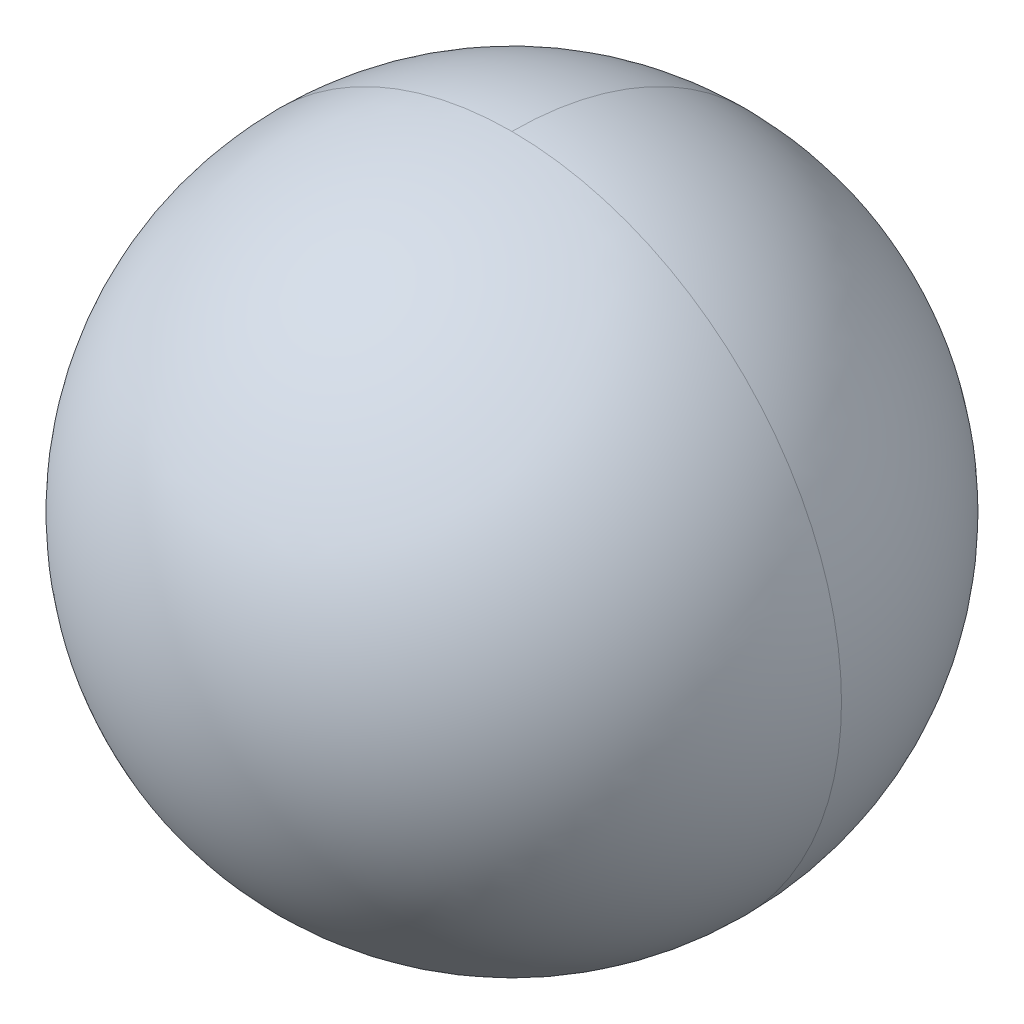
ISO-10303-21;
HEADER;
FILE_DESCRIPTION(('STEP AP214'),'2;1');
FILE_NAME('part.step','',(''),(''),'','','');
FILE_SCHEMA(('AUTOMOTIVE_DESIGN { 1 0 10303 214 1 1 1 1 }'));
ENDSEC;
DATA;
#1=APPLICATION_CONTEXT('core data for automotive mechanical design processes');
#2=APPLICATION_PROTOCOL_DEFINITION('international standard','automotive_design',2000,#1);
#3=PRODUCT_CONTEXT('',#1,'mechanical');
#4=PRODUCT('Part','Part','',(#3));
#5=PRODUCT_RELATED_PRODUCT_CATEGORY('part','',(#4));
#6=PRODUCT_DEFINITION_FORMATION('','',#4);
#7=PRODUCT_DEFINITION_CONTEXT('part definition',#1,'design');
#8=PRODUCT_DEFINITION('design','',#6,#7);
#9=PRODUCT_DEFINITION_SHAPE('','',#8);
#10=(LENGTH_UNIT() NAMED_UNIT(*) SI_UNIT(.MILLI.,.METRE.));
#11=(NAMED_UNIT(*) PLANE_ANGLE_UNIT() SI_UNIT($,.RADIAN.));
#12=(NAMED_UNIT(*) SI_UNIT($,.STERADIAN.) SOLID_ANGLE_UNIT());
#13=UNCERTAINTY_MEASURE_WITH_UNIT(LENGTH_MEASURE(1.E-05),#10,'distance_accuracy_value','');
#14=(GEOMETRIC_REPRESENTATION_CONTEXT(3) GLOBAL_UNCERTAINTY_ASSIGNED_CONTEXT((#13)) GLOBAL_UNIT_ASSIGNED_CONTEXT((#10,
#11,#12)) REPRESENTATION_CONTEXT('',''));
#15=CARTESIAN_POINT('',(0.,0.,0.));
#16=DIRECTION('',(0.,0.,1.));
#17=DIRECTION('',(1.,0.,0.));
#18=AXIS2_PLACEMENT_3D('',#15,#16,#17);
#19=CARTESIAN_POINT('',(0.,0.,0.));
#20=DIRECTION('',(0.,0.,1.));
#21=DIRECTION('',(0.,-1.,0.));
#22=AXIS2_PLACEMENT_3D('',#19,#20,#21);
#23=SPHERICAL_SURFACE('',#22,0.56007);
#24=CARTESIAN_POINT('',(0.,0.,0.));
#25=DIRECTION('',(0.,0.,1.));
#26=DIRECTION('',(0.,-1.,0.));
#27=AXIS2_PLACEMENT_3D('',#24,#25,#26);
#28=CIRCLE('',#27,0.56007);
#29=CARTESIAN_POINT('',(0.,-0.56007,0.));
#30=VERTEX_POINT('',#29);
#31=CARTESIAN_POINT('',(0.56007,0.,0.));
#32=VERTEX_POINT('',#31);
#33=EDGE_CURVE('E19',#30,#32,#28,.T.);
#34=ORIENTED_EDGE('',*,*,#33,.F.);
#35=CARTESIAN_POINT('',(0.,0.,0.));
#36=DIRECTION('',(-1.,0.,0.));
#37=DIRECTION('',(0.,0.,-1.));
#38=AXIS2_PLACEMENT_3D('',#35,#36,#37);
#39=CIRCLE('',#38,0.56007);
#40=CARTESIAN_POINT('',(0.,0.,-0.56007));
#41=VERTEX_POINT('',#40);
#42=EDGE_CURVE('E24',#41,#30,#39,.T.);
#43=ORIENTED_EDGE('',*,*,#42,.F.);
#44=CARTESIAN_POINT('',(0.,0.,0.));
#45=DIRECTION('',(1.,0.,0.));
#46=DIRECTION('',(0.,0.,-1.));
#47=AXIS2_PLACEMENT_3D('',#44,#45,#46);
#48=CIRCLE('',#47,0.56007);
#49=CARTESIAN_POINT('',(0.,0.56007,0.));
#50=VERTEX_POINT('',#49);
#51=EDGE_CURVE('E11',#41,#50,#48,.T.);
#52=ORIENTED_EDGE('',*,*,#51,.T.);
#53=CARTESIAN_POINT('',(0.,0.,0.));
#54=DIRECTION('',(0.,0.,-1.));
#55=DIRECTION('',(0.,1.,0.));
#56=AXIS2_PLACEMENT_3D('',#53,#54,#55);
#57=CIRCLE('',#56,0.56007);
#58=EDGE_CURVE('E38',#50,#32,#57,.T.);
#59=ORIENTED_EDGE('',*,*,#58,.T.);
#60=EDGE_LOOP('',(#34,#43,#52,#59));
#61=FACE_BOUND('',#60,.T.);
#62=ADVANCED_FACE('F16',(#61),#23,.T.);
#63=CARTESIAN_POINT('',(0.,0.,0.));
#64=DIRECTION('',(0.,0.,1.));
#65=DIRECTION('',(0.,-1.,0.));
#66=AXIS2_PLACEMENT_3D('',#63,#64,#65);
#67=SPHERICAL_SURFACE('',#66,0.56007);
#68=CARTESIAN_POINT('',(0.,0.,0.));
#69=DIRECTION('',(0.,0.,-1.));
#70=DIRECTION('',(-1.,0.,0.));
#71=AXIS2_PLACEMENT_3D('',#68,#69,#70);
#72=CIRCLE('',#71,0.56007);
#73=CARTESIAN_POINT('',(-0.56007,0.,0.));
#74=VERTEX_POINT('',#73);
#75=EDGE_CURVE('E49',#74,#50,#72,.T.);
#76=ORIENTED_EDGE('',*,*,#75,.T.);
#77=ORIENTED_EDGE('',*,*,#51,.F.);
#78=ORIENTED_EDGE('',*,*,#42,.T.);
#79=CARTESIAN_POINT('',(0.,0.,0.));
#80=DIRECTION('',(0.,0.,1.));
#81=DIRECTION('',(-1.,0.,0.));
#82=AXIS2_PLACEMENT_3D('',#79,#80,#81);
#83=CIRCLE('',#82,0.56007);
#84=EDGE_CURVE('E31',#74,#30,#83,.T.);
#85=ORIENTED_EDGE('',*,*,#84,.F.);
#86=EDGE_LOOP('',(#76,#77,#78,#85));
#87=FACE_BOUND('',#86,.T.);
#88=ADVANCED_FACE('F48',(#87),#67,.T.);
#89=CARTESIAN_POINT('',(0.,0.,0.));
#90=DIRECTION('',(1.,0.,0.));
#91=DIRECTION('',(0.,-1.,0.));
#92=AXIS2_PLACEMENT_3D('',#89,#90,#91);
#93=SPHERICAL_SURFACE('',#92,0.56007);
#94=CARTESIAN_POINT('',(0.,0.,0.));
#95=DIRECTION('',(0.,0.,1.));
#96=DIRECTION('',(-1.,0.,0.));
#97=AXIS2_PLACEMENT_3D('',#94,#95,#96);
#98=SPHERICAL_SURFACE('',#97,0.56007);
#99=ORIENTED_EDGE('',*,*,#84,.T.);
#100=ORIENTED_EDGE('',*,*,#33,.T.);
#101=ORIENTED_EDGE('',*,*,#58,.F.);
#102=ORIENTED_EDGE('',*,*,#75,.F.);
#103=EDGE_LOOP('',(#99,#100,#101,#102));
#104=FACE_BOUND('',#103,.T.);
#105=ADVANCED_FACE('F52',(#104),#98,.T.);
#106=CLOSED_SHELL('',(#62,#88,#105));
#107=MANIFOLD_SOLID_BREP('B1',#106);
#108=ADVANCED_BREP_SHAPE_REPRESENTATION('',(#18,#107),#14);
#109=SHAPE_DEFINITION_REPRESENTATION(#9,#108);
ENDSEC;
END-ISO-10303-21;
